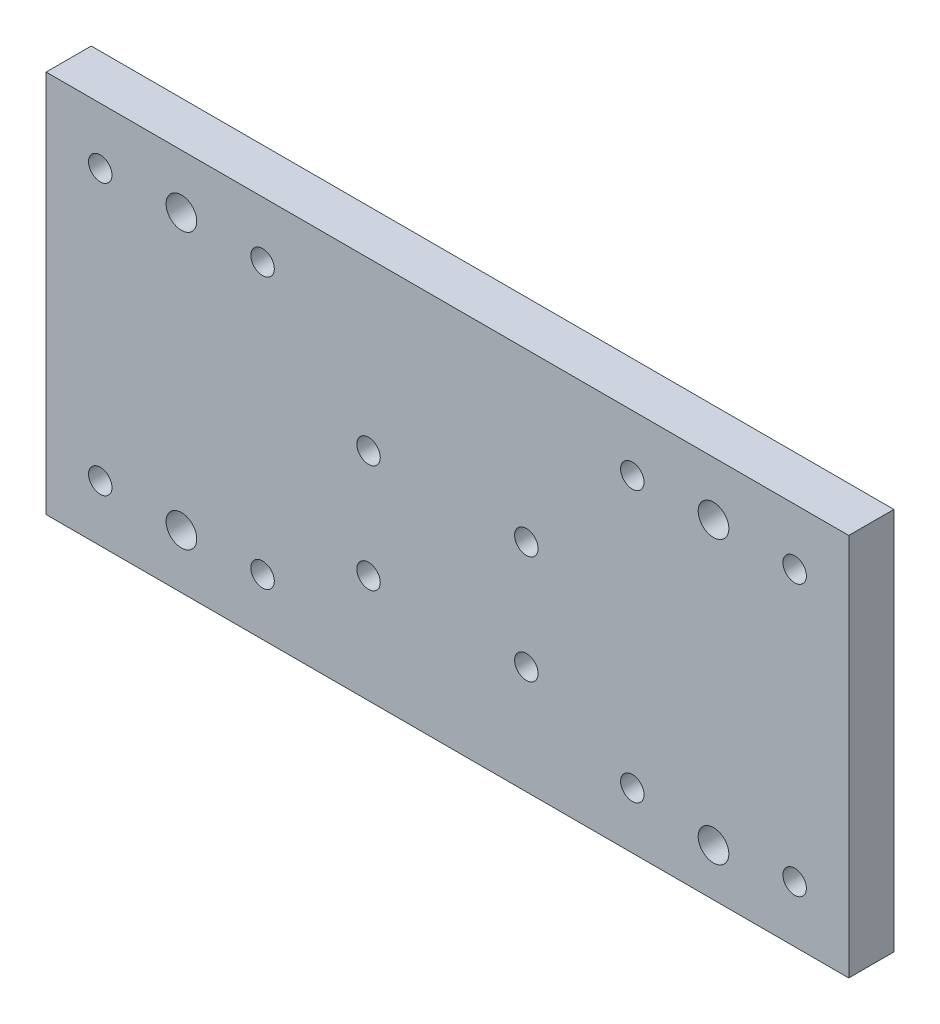
ISO-10303-21;
HEADER;
FILE_DESCRIPTION(('STEP AP214'),'2;1');
FILE_NAME('part.step','',(''),(''),'','','');
FILE_SCHEMA(('AUTOMOTIVE_DESIGN { 1 0 10303 214 1 1 1 1 }'));
ENDSEC;
DATA;
#1=APPLICATION_CONTEXT('core data for automotive mechanical design processes');
#2=APPLICATION_PROTOCOL_DEFINITION('international standard','automotive_design',2000,#1);
#3=PRODUCT_CONTEXT('',#1,'mechanical');
#4=PRODUCT('Part','Part','',(#3));
#5=PRODUCT_RELATED_PRODUCT_CATEGORY('part','',(#4));
#6=PRODUCT_DEFINITION_FORMATION('','',#4);
#7=PRODUCT_DEFINITION_CONTEXT('part definition',#1,'design');
#8=PRODUCT_DEFINITION('design','',#6,#7);
#9=PRODUCT_DEFINITION_SHAPE('','',#8);
#10=(LENGTH_UNIT() NAMED_UNIT(*) SI_UNIT(.MILLI.,.METRE.));
#11=(NAMED_UNIT(*) PLANE_ANGLE_UNIT() SI_UNIT($,.RADIAN.));
#12=(NAMED_UNIT(*) SI_UNIT($,.STERADIAN.) SOLID_ANGLE_UNIT());
#13=UNCERTAINTY_MEASURE_WITH_UNIT(LENGTH_MEASURE(1.E-05),#10,'distance_accuracy_value','');
#14=(GEOMETRIC_REPRESENTATION_CONTEXT(3) GLOBAL_UNCERTAINTY_ASSIGNED_CONTEXT((#13)) GLOBAL_UNIT_ASSIGNED_CONTEXT((#10,
#11,#12)) REPRESENTATION_CONTEXT('',''));
#15=CARTESIAN_POINT('',(0.,0.,0.));
#16=DIRECTION('',(0.,0.,1.));
#17=DIRECTION('',(1.,0.,0.));
#18=AXIS2_PLACEMENT_3D('',#15,#16,#17);
#19=CARTESIAN_POINT('',(0.,0.,10.));
#20=DIRECTION('',(0.,0.,1.));
#21=DIRECTION('',(1.,0.,0.));
#22=AXIS2_PLACEMENT_3D('',#19,#20,#21);
#23=PLANE('',#22);
#24=CARTESIAN_POINT('',(-59.,30.5,10.));
#25=DIRECTION('',(0.,0.,1.));
#26=DIRECTION('',(1.,0.,0.));
#27=AXIS2_PLACEMENT_3D('',#24,#25,#26);
#28=CIRCLE('',#27,3.39999999999999);
#29=CARTESIAN_POINT('',(-55.6,30.5,10.));
#30=VERTEX_POINT('',#29);
#31=EDGE_CURVE('E261',#30,#30,#28,.T.);
#32=ORIENTED_EDGE('',*,*,#31,.F.);
#33=EDGE_LOOP('',(#32));
#34=FACE_BOUND('',#33,.T.);
#35=CARTESIAN_POINT('',(-59.,-30.5,10.));
#36=DIRECTION('',(0.,0.,1.));
#37=DIRECTION('',(1.,0.,0.));
#38=AXIS2_PLACEMENT_3D('',#35,#36,#37);
#39=CIRCLE('',#38,3.39999999999999);
#40=CARTESIAN_POINT('',(-55.6,-30.5,10.));
#41=VERTEX_POINT('',#40);
#42=EDGE_CURVE('E253',#41,#41,#39,.T.);
#43=ORIENTED_EDGE('',*,*,#42,.F.);
#44=EDGE_LOOP('',(#43));
#45=FACE_BOUND('',#44,.T.);
#46=CARTESIAN_POINT('',(59.,-32.,10.));
#47=DIRECTION('',(0.,0.,1.));
#48=DIRECTION('',(1.,0.,0.));
#49=AXIS2_PLACEMENT_3D('',#46,#47,#48);
#50=CIRCLE('',#49,3.39999999999999);
#51=CARTESIAN_POINT('',(62.4,-32.,10.));
#52=VERTEX_POINT('',#51);
#53=EDGE_CURVE('E245',#52,#52,#50,.T.);
#54=ORIENTED_EDGE('',*,*,#53,.F.);
#55=EDGE_LOOP('',(#54));
#56=FACE_BOUND('',#55,.T.);
#57=CARTESIAN_POINT('',(59.,30.5,10.));
#58=DIRECTION('',(0.,0.,1.));
#59=DIRECTION('',(1.,0.,0.));
#60=AXIS2_PLACEMENT_3D('',#57,#58,#59);
#61=CIRCLE('',#60,3.39999999999999);
#62=CARTESIAN_POINT('',(62.4,30.5,10.));
#63=VERTEX_POINT('',#62);
#64=EDGE_CURVE('E237',#63,#63,#61,.T.);
#65=ORIENTED_EDGE('',*,*,#64,.F.);
#66=EDGE_LOOP('',(#65));
#67=FACE_BOUND('',#66,.T.);
#68=CARTESIAN_POINT('',(41.,30.,10.));
#69=DIRECTION('',(0.,0.,1.));
#70=DIRECTION('',(-1.,0.,0.));
#71=AXIS2_PLACEMENT_3D('',#68,#69,#70);
#72=CIRCLE('',#71,2.6);
#73=CARTESIAN_POINT('',(38.4,30.,10.));
#74=VERTEX_POINT('',#73);
#75=EDGE_CURVE('E214',#74,#74,#72,.T.);
#76=ORIENTED_EDGE('',*,*,#75,.F.);
#77=EDGE_LOOP('',(#76));
#78=FACE_BOUND('',#77,.T.);
#79=CARTESIAN_POINT('',(-17.5,5.50000000000001,10.));
#80=DIRECTION('',(0.,0.,1.));
#81=DIRECTION('',(1.,0.,0.));
#82=AXIS2_PLACEMENT_3D('',#79,#80,#81);
#83=CIRCLE('',#82,2.6);
#84=CARTESIAN_POINT('',(-14.9,5.50000000000001,10.));
#85=VERTEX_POINT('',#84);
#86=EDGE_CURVE('E198',#85,#85,#83,.T.);
#87=ORIENTED_EDGE('',*,*,#86,.F.);
#88=EDGE_LOOP('',(#87));
#89=FACE_BOUND('',#88,.T.);
#90=CARTESIAN_POINT('',(17.5,-18.5,10.));
#91=DIRECTION('',(0.,0.,1.));
#92=DIRECTION('',(1.,0.,0.));
#93=AXIS2_PLACEMENT_3D('',#90,#91,#92);
#94=CIRCLE('',#93,2.6);
#95=CARTESIAN_POINT('',(20.1,-18.5,10.));
#96=VERTEX_POINT('',#95);
#97=EDGE_CURVE('E182',#96,#96,#94,.T.);
#98=ORIENTED_EDGE('',*,*,#97,.F.);
#99=EDGE_LOOP('',(#98));
#100=FACE_BOUND('',#99,.T.);
#101=CARTESIAN_POINT('',(-17.5,-18.5,10.));
#102=DIRECTION('',(0.,0.,1.));
#103=DIRECTION('',(1.,0.,0.));
#104=AXIS2_PLACEMENT_3D('',#101,#102,#103);
#105=CIRCLE('',#104,2.6);
#106=CARTESIAN_POINT('',(-14.9,-18.5,10.));
#107=VERTEX_POINT('',#106);
#108=EDGE_CURVE('E166',#107,#107,#105,.T.);
#109=ORIENTED_EDGE('',*,*,#108,.F.);
#110=EDGE_LOOP('',(#109));
#111=FACE_BOUND('',#110,.T.);
#112=CARTESIAN_POINT('',(-41.,30.,10.));
#113=DIRECTION('',(0.,0.,1.));
#114=DIRECTION('',(1.,0.,0.));
#115=AXIS2_PLACEMENT_3D('',#112,#113,#114);
#116=CIRCLE('',#115,2.6);
#117=CARTESIAN_POINT('',(-38.4,30.,10.));
#118=VERTEX_POINT('',#117);
#119=EDGE_CURVE('E150',#118,#118,#116,.T.);
#120=ORIENTED_EDGE('',*,*,#119,.F.);
#121=EDGE_LOOP('',(#120));
#122=FACE_BOUND('',#121,.T.);
#123=CARTESIAN_POINT('',(-77.,-30.,10.));
#124=DIRECTION('',(0.,0.,1.));
#125=DIRECTION('',(1.,0.,0.));
#126=AXIS2_PLACEMENT_3D('',#123,#124,#125);
#127=CIRCLE('',#126,2.6);
#128=CARTESIAN_POINT('',(-74.4,-30.,10.));
#129=VERTEX_POINT('',#128);
#130=EDGE_CURVE('E120',#129,#129,#127,.T.);
#131=ORIENTED_EDGE('',*,*,#130,.F.);
#132=EDGE_LOOP('',(#131));
#133=FACE_BOUND('',#132,.T.);
#134=DIRECTION('',(0.,1.,0.));
#135=VECTOR('',#134,1.);
#136=CARTESIAN_POINT('',(89.,42.5,10.));
#137=LINE('',#136,#135);
#138=CARTESIAN_POINT('',(89.,-42.5,10.));
#139=VERTEX_POINT('',#138);
#140=CARTESIAN_POINT('',(89.,42.5,10.));
#141=VERTEX_POINT('',#140);
#142=EDGE_CURVE('E100',#139,#141,#137,.T.);
#143=ORIENTED_EDGE('',*,*,#142,.T.);
#144=DIRECTION('',(-1.,0.,0.));
#145=VECTOR('',#144,1.);
#146=CARTESIAN_POINT('',(-89.,42.5,10.));
#147=LINE('',#146,#145);
#148=CARTESIAN_POINT('',(-89.,42.5,10.));
#149=VERTEX_POINT('',#148);
#150=EDGE_CURVE('E95',#141,#149,#147,.T.);
#151=ORIENTED_EDGE('',*,*,#150,.T.);
#152=DIRECTION('',(0.,-1.,0.));
#153=VECTOR('',#152,1.);
#154=CARTESIAN_POINT('',(-89.,42.5,10.));
#155=LINE('',#154,#153);
#156=CARTESIAN_POINT('',(-89.,-42.5,10.));
#157=VERTEX_POINT('',#156);
#158=EDGE_CURVE('E98',#149,#157,#155,.T.);
#159=ORIENTED_EDGE('',*,*,#158,.T.);
#160=DIRECTION('',(1.,0.,0.));
#161=VECTOR('',#160,1.);
#162=CARTESIAN_POINT('',(-89.,-42.5,10.));
#163=LINE('',#162,#161);
#164=EDGE_CURVE('E65',#157,#139,#163,.T.);
#165=ORIENTED_EDGE('',*,*,#164,.T.);
#166=EDGE_LOOP('',(#143,#151,#159,#165));
#167=FACE_BOUND('',#166,.T.);
#168=CARTESIAN_POINT('',(-41.,-30.,10.));
#169=DIRECTION('',(0.,0.,1.));
#170=DIRECTION('',(1.,0.,0.));
#171=AXIS2_PLACEMENT_3D('',#168,#169,#170);
#172=CIRCLE('',#171,2.6);
#173=CARTESIAN_POINT('',(-38.4,-30.,10.));
#174=VERTEX_POINT('',#173);
#175=EDGE_CURVE('E142',#174,#174,#172,.T.);
#176=ORIENTED_EDGE('',*,*,#175,.F.);
#177=EDGE_LOOP('',(#176));
#178=FACE_BOUND('',#177,.T.);
#179=CARTESIAN_POINT('',(-77.,30.,10.));
#180=DIRECTION('',(0.,0.,1.));
#181=DIRECTION('',(1.,0.,0.));
#182=AXIS2_PLACEMENT_3D('',#179,#180,#181);
#183=CIRCLE('',#182,2.6);
#184=CARTESIAN_POINT('',(-74.4,30.,10.));
#185=VERTEX_POINT('',#184);
#186=EDGE_CURVE('E158',#185,#185,#183,.T.);
#187=ORIENTED_EDGE('',*,*,#186,.F.);
#188=EDGE_LOOP('',(#187));
#189=FACE_BOUND('',#188,.T.);
#190=CARTESIAN_POINT('',(77.,-30.,10.));
#191=DIRECTION('',(0.,0.,1.));
#192=DIRECTION('',(-1.,0.,0.));
#193=AXIS2_PLACEMENT_3D('',#190,#191,#192);
#194=CIRCLE('',#193,2.6);
#195=CARTESIAN_POINT('',(74.4,-30.,10.));
#196=VERTEX_POINT('',#195);
#197=EDGE_CURVE('E174',#196,#196,#194,.T.);
#198=ORIENTED_EDGE('',*,*,#197,.F.);
#199=EDGE_LOOP('',(#198));
#200=FACE_BOUND('',#199,.T.);
#201=CARTESIAN_POINT('',(17.5,5.50000000000001,10.));
#202=DIRECTION('',(0.,0.,1.));
#203=DIRECTION('',(1.,0.,0.));
#204=AXIS2_PLACEMENT_3D('',#201,#202,#203);
#205=CIRCLE('',#204,2.6);
#206=CARTESIAN_POINT('',(20.1,5.50000000000001,10.));
#207=VERTEX_POINT('',#206);
#208=EDGE_CURVE('E190',#207,#207,#205,.T.);
#209=ORIENTED_EDGE('',*,*,#208,.F.);
#210=EDGE_LOOP('',(#209));
#211=FACE_BOUND('',#210,.T.);
#212=CARTESIAN_POINT('',(41.,-30.,10.));
#213=DIRECTION('',(0.,0.,1.));
#214=DIRECTION('',(-1.,0.,0.));
#215=AXIS2_PLACEMENT_3D('',#212,#213,#214);
#216=CIRCLE('',#215,2.6);
#217=CARTESIAN_POINT('',(38.4,-30.,10.));
#218=VERTEX_POINT('',#217);
#219=EDGE_CURVE('E206',#218,#218,#216,.T.);
#220=ORIENTED_EDGE('',*,*,#219,.F.);
#221=EDGE_LOOP('',(#220));
#222=FACE_BOUND('',#221,.T.);
#223=CARTESIAN_POINT('',(77.,30.,10.));
#224=DIRECTION('',(0.,0.,1.));
#225=DIRECTION('',(-1.,0.,0.));
#226=AXIS2_PLACEMENT_3D('',#223,#224,#225);
#227=CIRCLE('',#226,2.6);
#228=CARTESIAN_POINT('',(74.4,30.,10.));
#229=VERTEX_POINT('',#228);
#230=EDGE_CURVE('E222',#229,#229,#227,.T.);
#231=ORIENTED_EDGE('',*,*,#230,.F.);
#232=EDGE_LOOP('',(#231));
#233=FACE_BOUND('',#232,.T.);
#234=ADVANCED_FACE('F47',(#34,#45,#56,#67,#78,#89,#100,#111,#122,#133,#167,#178,#189,#200,#211,
#222,#233),#23,.T.);
#235=CARTESIAN_POINT('',(0.,0.,0.));
#236=DIRECTION('',(0.,0.,1.));
#237=DIRECTION('',(1.,0.,0.));
#238=AXIS2_PLACEMENT_3D('',#235,#236,#237);
#239=PLANE('',#238);
#240=CARTESIAN_POINT('',(-59.,30.5,0.));
#241=DIRECTION('',(0.,0.,1.));
#242=DIRECTION('',(1.,0.,0.));
#243=AXIS2_PLACEMENT_3D('',#240,#241,#242);
#244=CIRCLE('',#243,3.39999999999999);
#245=CARTESIAN_POINT('',(-55.6,30.5,0.));
#246=VERTEX_POINT('',#245);
#247=EDGE_CURVE('E257',#246,#246,#244,.T.);
#248=ORIENTED_EDGE('',*,*,#247,.T.);
#249=EDGE_LOOP('',(#248));
#250=FACE_BOUND('',#249,.T.);
#251=CARTESIAN_POINT('',(-59.,-30.5,0.));
#252=DIRECTION('',(0.,0.,1.));
#253=DIRECTION('',(1.,0.,0.));
#254=AXIS2_PLACEMENT_3D('',#251,#252,#253);
#255=CIRCLE('',#254,3.39999999999999);
#256=CARTESIAN_POINT('',(-55.6,-30.5,0.));
#257=VERTEX_POINT('',#256);
#258=EDGE_CURVE('E249',#257,#257,#255,.T.);
#259=ORIENTED_EDGE('',*,*,#258,.T.);
#260=EDGE_LOOP('',(#259));
#261=FACE_BOUND('',#260,.T.);
#262=CARTESIAN_POINT('',(59.,-32.,0.));
#263=DIRECTION('',(0.,0.,1.));
#264=DIRECTION('',(1.,0.,0.));
#265=AXIS2_PLACEMENT_3D('',#262,#263,#264);
#266=CIRCLE('',#265,3.39999999999999);
#267=CARTESIAN_POINT('',(62.4,-32.,0.));
#268=VERTEX_POINT('',#267);
#269=EDGE_CURVE('E241',#268,#268,#266,.T.);
#270=ORIENTED_EDGE('',*,*,#269,.T.);
#271=EDGE_LOOP('',(#270));
#272=FACE_BOUND('',#271,.T.);
#273=CARTESIAN_POINT('',(59.,30.5,0.));
#274=DIRECTION('',(0.,0.,1.));
#275=DIRECTION('',(1.,0.,0.));
#276=AXIS2_PLACEMENT_3D('',#273,#274,#275);
#277=CIRCLE('',#276,3.39999999999999);
#278=CARTESIAN_POINT('',(62.4,30.5,0.));
#279=VERTEX_POINT('',#278);
#280=EDGE_CURVE('E230',#279,#279,#277,.T.);
#281=ORIENTED_EDGE('',*,*,#280,.T.);
#282=EDGE_LOOP('',(#281));
#283=FACE_BOUND('',#282,.T.);
#284=DIRECTION('',(0.,1.,0.));
#285=VECTOR('',#284,1.);
#286=CARTESIAN_POINT('',(89.,42.5,0.));
#287=LINE('',#286,#285);
#288=CARTESIAN_POINT('',(89.,-42.5,0.));
#289=VERTEX_POINT('',#288);
#290=CARTESIAN_POINT('',(89.,42.5,0.));
#291=VERTEX_POINT('',#290);
#292=EDGE_CURVE('E116',#289,#291,#287,.T.);
#293=ORIENTED_EDGE('',*,*,#292,.F.);
#294=DIRECTION('',(1.,0.,0.));
#295=VECTOR('',#294,1.);
#296=CARTESIAN_POINT('',(-89.,-42.5,0.));
#297=LINE('',#296,#295);
#298=CARTESIAN_POINT('',(-89.,-42.5,0.));
#299=VERTEX_POINT('',#298);
#300=EDGE_CURVE('E88',#299,#289,#297,.T.);
#301=ORIENTED_EDGE('',*,*,#300,.F.);
#302=DIRECTION('',(0.,-1.,0.));
#303=VECTOR('',#302,1.);
#304=CARTESIAN_POINT('',(-89.,42.5,0.));
#305=LINE('',#304,#303);
#306=CARTESIAN_POINT('',(-89.,42.5,0.));
#307=VERTEX_POINT('',#306);
#308=EDGE_CURVE('E82',#307,#299,#305,.T.);
#309=ORIENTED_EDGE('',*,*,#308,.F.);
#310=DIRECTION('',(-1.,0.,0.));
#311=VECTOR('',#310,1.);
#312=CARTESIAN_POINT('',(-89.,42.5,0.));
#313=LINE('',#312,#311);
#314=EDGE_CURVE('E105',#291,#307,#313,.T.);
#315=ORIENTED_EDGE('',*,*,#314,.F.);
#316=EDGE_LOOP('',(#293,#301,#309,#315));
#317=FACE_BOUND('',#316,.T.);
#318=CARTESIAN_POINT('',(-77.,-30.,0.));
#319=DIRECTION('',(0.,0.,1.));
#320=DIRECTION('',(1.,0.,0.));
#321=AXIS2_PLACEMENT_3D('',#318,#319,#320);
#322=CIRCLE('',#321,2.6);
#323=CARTESIAN_POINT('',(-74.4,-30.,0.));
#324=VERTEX_POINT('',#323);
#325=EDGE_CURVE('E138',#324,#324,#322,.T.);
#326=ORIENTED_EDGE('',*,*,#325,.T.);
#327=EDGE_LOOP('',(#326));
#328=FACE_BOUND('',#327,.T.);
#329=CARTESIAN_POINT('',(-41.,-30.,0.));
#330=DIRECTION('',(0.,0.,1.));
#331=DIRECTION('',(1.,0.,0.));
#332=AXIS2_PLACEMENT_3D('',#329,#330,#331);
#333=CIRCLE('',#332,2.6);
#334=CARTESIAN_POINT('',(-38.4,-30.,0.));
#335=VERTEX_POINT('',#334);
#336=EDGE_CURVE('E146',#335,#335,#333,.T.);
#337=ORIENTED_EDGE('',*,*,#336,.T.);
#338=EDGE_LOOP('',(#337));
#339=FACE_BOUND('',#338,.T.);
#340=CARTESIAN_POINT('',(-41.,30.,0.));
#341=DIRECTION('',(0.,0.,1.));
#342=DIRECTION('',(1.,0.,0.));
#343=AXIS2_PLACEMENT_3D('',#340,#341,#342);
#344=CIRCLE('',#343,2.6);
#345=CARTESIAN_POINT('',(-38.4,30.,0.));
#346=VERTEX_POINT('',#345);
#347=EDGE_CURVE('E154',#346,#346,#344,.T.);
#348=ORIENTED_EDGE('',*,*,#347,.T.);
#349=EDGE_LOOP('',(#348));
#350=FACE_BOUND('',#349,.T.);
#351=CARTESIAN_POINT('',(-77.,30.,0.));
#352=DIRECTION('',(0.,0.,1.));
#353=DIRECTION('',(1.,0.,0.));
#354=AXIS2_PLACEMENT_3D('',#351,#352,#353);
#355=CIRCLE('',#354,2.6);
#356=CARTESIAN_POINT('',(-74.4,30.,0.));
#357=VERTEX_POINT('',#356);
#358=EDGE_CURVE('E162',#357,#357,#355,.T.);
#359=ORIENTED_EDGE('',*,*,#358,.T.);
#360=EDGE_LOOP('',(#359));
#361=FACE_BOUND('',#360,.T.);
#362=CARTESIAN_POINT('',(-17.5,-18.5,0.));
#363=DIRECTION('',(0.,0.,1.));
#364=DIRECTION('',(1.,0.,0.));
#365=AXIS2_PLACEMENT_3D('',#362,#363,#364);
#366=CIRCLE('',#365,2.6);
#367=CARTESIAN_POINT('',(-14.9,-18.5,0.));
#368=VERTEX_POINT('',#367);
#369=EDGE_CURVE('E170',#368,#368,#366,.T.);
#370=ORIENTED_EDGE('',*,*,#369,.T.);
#371=EDGE_LOOP('',(#370));
#372=FACE_BOUND('',#371,.T.);
#373=CARTESIAN_POINT('',(77.,-30.,0.));
#374=DIRECTION('',(0.,0.,1.));
#375=DIRECTION('',(-1.,0.,0.));
#376=AXIS2_PLACEMENT_3D('',#373,#374,#375);
#377=CIRCLE('',#376,2.6);
#378=CARTESIAN_POINT('',(74.4,-30.,0.));
#379=VERTEX_POINT('',#378);
#380=EDGE_CURVE('E178',#379,#379,#377,.T.);
#381=ORIENTED_EDGE('',*,*,#380,.T.);
#382=EDGE_LOOP('',(#381));
#383=FACE_BOUND('',#382,.T.);
#384=CARTESIAN_POINT('',(17.5,-18.5,0.));
#385=DIRECTION('',(0.,0.,1.));
#386=DIRECTION('',(1.,0.,0.));
#387=AXIS2_PLACEMENT_3D('',#384,#385,#386);
#388=CIRCLE('',#387,2.6);
#389=CARTESIAN_POINT('',(20.1,-18.5,0.));
#390=VERTEX_POINT('',#389);
#391=EDGE_CURVE('E186',#390,#390,#388,.T.);
#392=ORIENTED_EDGE('',*,*,#391,.T.);
#393=EDGE_LOOP('',(#392));
#394=FACE_BOUND('',#393,.T.);
#395=CARTESIAN_POINT('',(17.5,5.50000000000001,0.));
#396=DIRECTION('',(0.,0.,1.));
#397=DIRECTION('',(1.,0.,0.));
#398=AXIS2_PLACEMENT_3D('',#395,#396,#397);
#399=CIRCLE('',#398,2.6);
#400=CARTESIAN_POINT('',(20.1,5.50000000000001,0.));
#401=VERTEX_POINT('',#400);
#402=EDGE_CURVE('E194',#401,#401,#399,.T.);
#403=ORIENTED_EDGE('',*,*,#402,.T.);
#404=EDGE_LOOP('',(#403));
#405=FACE_BOUND('',#404,.T.);
#406=CARTESIAN_POINT('',(-17.5,5.50000000000001,0.));
#407=DIRECTION('',(0.,0.,1.));
#408=DIRECTION('',(1.,0.,0.));
#409=AXIS2_PLACEMENT_3D('',#406,#407,#408);
#410=CIRCLE('',#409,2.6);
#411=CARTESIAN_POINT('',(-14.9,5.50000000000001,0.));
#412=VERTEX_POINT('',#411);
#413=EDGE_CURVE('E202',#412,#412,#410,.T.);
#414=ORIENTED_EDGE('',*,*,#413,.T.);
#415=EDGE_LOOP('',(#414));
#416=FACE_BOUND('',#415,.T.);
#417=CARTESIAN_POINT('',(41.,-30.,0.));
#418=DIRECTION('',(0.,0.,1.));
#419=DIRECTION('',(-1.,0.,0.));
#420=AXIS2_PLACEMENT_3D('',#417,#418,#419);
#421=CIRCLE('',#420,2.6);
#422=CARTESIAN_POINT('',(38.4,-30.,0.));
#423=VERTEX_POINT('',#422);
#424=EDGE_CURVE('E210',#423,#423,#421,.T.);
#425=ORIENTED_EDGE('',*,*,#424,.T.);
#426=EDGE_LOOP('',(#425));
#427=FACE_BOUND('',#426,.T.);
#428=CARTESIAN_POINT('',(41.,30.,0.));
#429=DIRECTION('',(0.,0.,1.));
#430=DIRECTION('',(-1.,0.,0.));
#431=AXIS2_PLACEMENT_3D('',#428,#429,#430);
#432=CIRCLE('',#431,2.6);
#433=CARTESIAN_POINT('',(38.4,30.,0.));
#434=VERTEX_POINT('',#433);
#435=EDGE_CURVE('E218',#434,#434,#432,.T.);
#436=ORIENTED_EDGE('',*,*,#435,.T.);
#437=EDGE_LOOP('',(#436));
#438=FACE_BOUND('',#437,.T.);
#439=CARTESIAN_POINT('',(77.,30.,0.));
#440=DIRECTION('',(0.,0.,1.));
#441=DIRECTION('',(-1.,0.,0.));
#442=AXIS2_PLACEMENT_3D('',#439,#440,#441);
#443=CIRCLE('',#442,2.6);
#444=CARTESIAN_POINT('',(74.4,30.,0.));
#445=VERTEX_POINT('',#444);
#446=EDGE_CURVE('E226',#445,#445,#443,.T.);
#447=ORIENTED_EDGE('',*,*,#446,.T.);
#448=EDGE_LOOP('',(#447));
#449=FACE_BOUND('',#448,.T.);
#450=ADVANCED_FACE('F133',(#250,#261,#272,#283,#317,#328,#339,#350,#361,#372,#383,#394,#405,
#416,#427,#438,#449),#239,.F.);
#451=CARTESIAN_POINT('',(89.,42.5,10.));
#452=DIRECTION('',(-1.,0.,0.));
#453=DIRECTION('',(0.,-1.,0.));
#454=AXIS2_PLACEMENT_3D('',#451,#452,#453);
#455=PLANE('',#454);
#456=ORIENTED_EDGE('',*,*,#292,.T.);
#457=DIRECTION('',(0.,0.,-1.));
#458=VECTOR('',#457,1.);
#459=CARTESIAN_POINT('',(89.,42.5,10.));
#460=LINE('',#459,#458);
#461=EDGE_CURVE('E11',#141,#291,#460,.T.);
#462=ORIENTED_EDGE('',*,*,#461,.F.);
#463=ORIENTED_EDGE('',*,*,#142,.F.);
#464=DIRECTION('',(0.,0.,-1.));
#465=VECTOR('',#464,1.);
#466=CARTESIAN_POINT('',(89.,-42.5,10.));
#467=LINE('',#466,#465);
#468=EDGE_CURVE('E112',#139,#289,#467,.T.);
#469=ORIENTED_EDGE('',*,*,#468,.T.);
#470=EDGE_LOOP('',(#456,#462,#463,#469));
#471=FACE_BOUND('',#470,.T.);
#472=ADVANCED_FACE('F49',(#471),#455,.F.);
#473=CARTESIAN_POINT('',(-89.,42.5,10.));
#474=DIRECTION('',(0.,-1.,0.));
#475=DIRECTION('',(1.,0.,0.));
#476=AXIS2_PLACEMENT_3D('',#473,#474,#475);
#477=PLANE('',#476);
#478=ORIENTED_EDGE('',*,*,#314,.T.);
#479=DIRECTION('',(0.,0.,-1.));
#480=VECTOR('',#479,1.);
#481=CARTESIAN_POINT('',(-89.,42.5,10.));
#482=LINE('',#481,#480);
#483=EDGE_CURVE('E57',#149,#307,#482,.T.);
#484=ORIENTED_EDGE('',*,*,#483,.F.);
#485=ORIENTED_EDGE('',*,*,#150,.F.);
#486=ORIENTED_EDGE('',*,*,#461,.T.);
#487=EDGE_LOOP('',(#478,#484,#485,#486));
#488=FACE_BOUND('',#487,.T.);
#489=ADVANCED_FACE('F104',(#488),#477,.F.);
#490=CARTESIAN_POINT('',(-89.,42.5,10.));
#491=DIRECTION('',(1.,0.,0.));
#492=DIRECTION('',(0.,1.,0.));
#493=AXIS2_PLACEMENT_3D('',#490,#491,#492);
#494=PLANE('',#493);
#495=ORIENTED_EDGE('',*,*,#308,.T.);
#496=DIRECTION('',(0.,0.,-1.));
#497=VECTOR('',#496,1.);
#498=CARTESIAN_POINT('',(-89.,-42.5,10.));
#499=LINE('',#498,#497);
#500=EDGE_CURVE('E107',#157,#299,#499,.T.);
#501=ORIENTED_EDGE('',*,*,#500,.F.);
#502=ORIENTED_EDGE('',*,*,#158,.F.);
#503=ORIENTED_EDGE('',*,*,#483,.T.);
#504=EDGE_LOOP('',(#495,#501,#502,#503));
#505=FACE_BOUND('',#504,.T.);
#506=ADVANCED_FACE('F108',(#505),#494,.F.);
#507=CARTESIAN_POINT('',(-89.,-42.5,10.));
#508=DIRECTION('',(0.,1.,0.));
#509=DIRECTION('',(-1.,0.,0.));
#510=AXIS2_PLACEMENT_3D('',#507,#508,#509);
#511=PLANE('',#510);
#512=ORIENTED_EDGE('',*,*,#300,.T.);
#513=ORIENTED_EDGE('',*,*,#468,.F.);
#514=ORIENTED_EDGE('',*,*,#164,.F.);
#515=ORIENTED_EDGE('',*,*,#500,.T.);
#516=EDGE_LOOP('',(#512,#513,#514,#515));
#517=FACE_BOUND('',#516,.T.);
#518=ADVANCED_FACE('F130',(#517),#511,.F.);
#519=CARTESIAN_POINT('',(-77.,-30.,10.));
#520=DIRECTION('',(0.,0.,-1.));
#521=DIRECTION('',(-1.,0.,0.));
#522=AXIS2_PLACEMENT_3D('',#519,#520,#521);
#523=CYLINDRICAL_SURFACE('',#522,2.6);
#524=ORIENTED_EDGE('',*,*,#130,.T.);
#525=EDGE_LOOP('',(#524));
#526=FACE_BOUND('',#525,.T.);
#527=ORIENTED_EDGE('',*,*,#325,.F.);
#528=EDGE_LOOP('',(#527));
#529=FACE_BOUND('',#528,.T.);
#530=ADVANCED_FACE('F289',(#526,#529),#523,.F.);
#531=CARTESIAN_POINT('',(-41.,-30.,10.));
#532=DIRECTION('',(0.,0.,-1.));
#533=DIRECTION('',(-1.,0.,0.));
#534=AXIS2_PLACEMENT_3D('',#531,#532,#533);
#535=CYLINDRICAL_SURFACE('',#534,2.6);
#536=ORIENTED_EDGE('',*,*,#175,.T.);
#537=EDGE_LOOP('',(#536));
#538=FACE_BOUND('',#537,.T.);
#539=ORIENTED_EDGE('',*,*,#336,.F.);
#540=EDGE_LOOP('',(#539));
#541=FACE_BOUND('',#540,.T.);
#542=ADVANCED_FACE('F292',(#538,#541),#535,.F.);
#543=CARTESIAN_POINT('',(-41.,30.,10.));
#544=DIRECTION('',(0.,0.,-1.));
#545=DIRECTION('',(-1.,0.,0.));
#546=AXIS2_PLACEMENT_3D('',#543,#544,#545);
#547=CYLINDRICAL_SURFACE('',#546,2.6);
#548=ORIENTED_EDGE('',*,*,#119,.T.);
#549=EDGE_LOOP('',(#548));
#550=FACE_BOUND('',#549,.T.);
#551=ORIENTED_EDGE('',*,*,#347,.F.);
#552=EDGE_LOOP('',(#551));
#553=FACE_BOUND('',#552,.T.);
#554=ADVANCED_FACE('F365',(#550,#553),#547,.F.);
#555=CARTESIAN_POINT('',(-77.,30.,10.));
#556=DIRECTION('',(0.,0.,-1.));
#557=DIRECTION('',(-1.,0.,0.));
#558=AXIS2_PLACEMENT_3D('',#555,#556,#557);
#559=CYLINDRICAL_SURFACE('',#558,2.6);
#560=ORIENTED_EDGE('',*,*,#186,.T.);
#561=EDGE_LOOP('',(#560));
#562=FACE_BOUND('',#561,.T.);
#563=ORIENTED_EDGE('',*,*,#358,.F.);
#564=EDGE_LOOP('',(#563));
#565=FACE_BOUND('',#564,.T.);
#566=ADVANCED_FACE('F361',(#562,#565),#559,.F.);
#567=CARTESIAN_POINT('',(-17.5,-18.5,10.));
#568=DIRECTION('',(0.,0.,-1.));
#569=DIRECTION('',(-1.,0.,0.));
#570=AXIS2_PLACEMENT_3D('',#567,#568,#569);
#571=CYLINDRICAL_SURFACE('',#570,2.6);
#572=ORIENTED_EDGE('',*,*,#108,.T.);
#573=EDGE_LOOP('',(#572));
#574=FACE_BOUND('',#573,.T.);
#575=ORIENTED_EDGE('',*,*,#369,.F.);
#576=EDGE_LOOP('',(#575));
#577=FACE_BOUND('',#576,.T.);
#578=ADVANCED_FACE('F357',(#574,#577),#571,.F.);
#579=CARTESIAN_POINT('',(77.,-30.,10.));
#580=DIRECTION('',(0.,0.,-1.));
#581=DIRECTION('',(-1.,0.,0.));
#582=AXIS2_PLACEMENT_3D('',#579,#580,#581);
#583=CYLINDRICAL_SURFACE('',#582,2.6);
#584=ORIENTED_EDGE('',*,*,#197,.T.);
#585=EDGE_LOOP('',(#584));
#586=FACE_BOUND('',#585,.T.);
#587=ORIENTED_EDGE('',*,*,#380,.F.);
#588=EDGE_LOOP('',(#587));
#589=FACE_BOUND('',#588,.T.);
#590=ADVANCED_FACE('F353',(#586,#589),#583,.F.);
#591=CARTESIAN_POINT('',(17.5,-18.5,10.));
#592=DIRECTION('',(0.,0.,-1.));
#593=DIRECTION('',(-1.,0.,0.));
#594=AXIS2_PLACEMENT_3D('',#591,#592,#593);
#595=CYLINDRICAL_SURFACE('',#594,2.6);
#596=ORIENTED_EDGE('',*,*,#97,.T.);
#597=EDGE_LOOP('',(#596));
#598=FACE_BOUND('',#597,.T.);
#599=ORIENTED_EDGE('',*,*,#391,.F.);
#600=EDGE_LOOP('',(#599));
#601=FACE_BOUND('',#600,.T.);
#602=ADVANCED_FACE('F349',(#598,#601),#595,.F.);
#603=CARTESIAN_POINT('',(17.5,5.50000000000001,10.));
#604=DIRECTION('',(0.,0.,-1.));
#605=DIRECTION('',(-1.,0.,0.));
#606=AXIS2_PLACEMENT_3D('',#603,#604,#605);
#607=CYLINDRICAL_SURFACE('',#606,2.6);
#608=ORIENTED_EDGE('',*,*,#208,.T.);
#609=EDGE_LOOP('',(#608));
#610=FACE_BOUND('',#609,.T.);
#611=ORIENTED_EDGE('',*,*,#402,.F.);
#612=EDGE_LOOP('',(#611));
#613=FACE_BOUND('',#612,.T.);
#614=ADVANCED_FACE('F345',(#610,#613),#607,.F.);
#615=CARTESIAN_POINT('',(-17.5,5.50000000000001,10.));
#616=DIRECTION('',(0.,0.,-1.));
#617=DIRECTION('',(-1.,0.,0.));
#618=AXIS2_PLACEMENT_3D('',#615,#616,#617);
#619=CYLINDRICAL_SURFACE('',#618,2.6);
#620=ORIENTED_EDGE('',*,*,#86,.T.);
#621=EDGE_LOOP('',(#620));
#622=FACE_BOUND('',#621,.T.);
#623=ORIENTED_EDGE('',*,*,#413,.F.);
#624=EDGE_LOOP('',(#623));
#625=FACE_BOUND('',#624,.T.);
#626=ADVANCED_FACE('F341',(#622,#625),#619,.F.);
#627=CARTESIAN_POINT('',(41.,-30.,10.));
#628=DIRECTION('',(0.,0.,-1.));
#629=DIRECTION('',(-1.,0.,0.));
#630=AXIS2_PLACEMENT_3D('',#627,#628,#629);
#631=CYLINDRICAL_SURFACE('',#630,2.6);
#632=ORIENTED_EDGE('',*,*,#219,.T.);
#633=EDGE_LOOP('',(#632));
#634=FACE_BOUND('',#633,.T.);
#635=ORIENTED_EDGE('',*,*,#424,.F.);
#636=EDGE_LOOP('',(#635));
#637=FACE_BOUND('',#636,.T.);
#638=ADVANCED_FACE('F334',(#634,#637),#631,.F.);
#639=CARTESIAN_POINT('',(41.,30.,10.));
#640=DIRECTION('',(0.,0.,-1.));
#641=DIRECTION('',(-1.,0.,0.));
#642=AXIS2_PLACEMENT_3D('',#639,#640,#641);
#643=CYLINDRICAL_SURFACE('',#642,2.6);
#644=ORIENTED_EDGE('',*,*,#75,.T.);
#645=EDGE_LOOP('',(#644));
#646=FACE_BOUND('',#645,.T.);
#647=ORIENTED_EDGE('',*,*,#435,.F.);
#648=EDGE_LOOP('',(#647));
#649=FACE_BOUND('',#648,.T.);
#650=ADVANCED_FACE('F324',(#646,#649),#643,.F.);
#651=CARTESIAN_POINT('',(77.,30.,10.));
#652=DIRECTION('',(0.,0.,-1.));
#653=DIRECTION('',(-1.,0.,0.));
#654=AXIS2_PLACEMENT_3D('',#651,#652,#653);
#655=CYLINDRICAL_SURFACE('',#654,2.6);
#656=ORIENTED_EDGE('',*,*,#230,.T.);
#657=EDGE_LOOP('',(#656));
#658=FACE_BOUND('',#657,.T.);
#659=ORIENTED_EDGE('',*,*,#446,.F.);
#660=EDGE_LOOP('',(#659));
#661=FACE_BOUND('',#660,.T.);
#662=ADVANCED_FACE('F321',(#658,#661),#655,.F.);
#663=CARTESIAN_POINT('',(59.,30.5,10.));
#664=DIRECTION('',(0.,0.,1.));
#665=DIRECTION('',(1.,0.,0.));
#666=AXIS2_PLACEMENT_3D('',#663,#664,#665);
#667=CYLINDRICAL_SURFACE('',#666,3.39999999999999);
#668=ORIENTED_EDGE('',*,*,#280,.F.);
#669=EDGE_LOOP('',(#668));
#670=FACE_BOUND('',#669,.T.);
#671=ORIENTED_EDGE('',*,*,#64,.T.);
#672=EDGE_LOOP('',(#671));
#673=FACE_BOUND('',#672,.T.);
#674=ADVANCED_FACE('F323',(#670,#673),#667,.F.);
#675=CARTESIAN_POINT('',(59.,-32.,10.));
#676=DIRECTION('',(0.,0.,1.));
#677=DIRECTION('',(1.,0.,0.));
#678=AXIS2_PLACEMENT_3D('',#675,#676,#677);
#679=CYLINDRICAL_SURFACE('',#678,3.39999999999999);
#680=ORIENTED_EDGE('',*,*,#269,.F.);
#681=EDGE_LOOP('',(#680));
#682=FACE_BOUND('',#681,.T.);
#683=ORIENTED_EDGE('',*,*,#53,.T.);
#684=EDGE_LOOP('',(#683));
#685=FACE_BOUND('',#684,.T.);
#686=ADVANCED_FACE('F331',(#682,#685),#679,.F.);
#687=CARTESIAN_POINT('',(-59.,-30.5,10.));
#688=DIRECTION('',(0.,0.,1.));
#689=DIRECTION('',(1.,0.,0.));
#690=AXIS2_PLACEMENT_3D('',#687,#688,#689);
#691=CYLINDRICAL_SURFACE('',#690,3.39999999999999);
#692=ORIENTED_EDGE('',*,*,#258,.F.);
#693=EDGE_LOOP('',(#692));
#694=FACE_BOUND('',#693,.T.);
#695=ORIENTED_EDGE('',*,*,#42,.T.);
#696=EDGE_LOOP('',(#695));
#697=FACE_BOUND('',#696,.T.);
#698=ADVANCED_FACE('F485',(#694,#697),#691,.F.);
#699=CARTESIAN_POINT('',(-59.,30.5,10.));
#700=DIRECTION('',(0.,0.,1.));
#701=DIRECTION('',(1.,0.,0.));
#702=AXIS2_PLACEMENT_3D('',#699,#700,#701);
#703=CYLINDRICAL_SURFACE('',#702,3.39999999999999);
#704=ORIENTED_EDGE('',*,*,#247,.F.);
#705=EDGE_LOOP('',(#704));
#706=FACE_BOUND('',#705,.T.);
#707=ORIENTED_EDGE('',*,*,#31,.T.);
#708=EDGE_LOOP('',(#707));
#709=FACE_BOUND('',#708,.T.);
#710=ADVANCED_FACE('F266',(#706,#709),#703,.F.);
#711=CLOSED_SHELL('',(#234,#450,#472,#489,#506,#518,#530,#542,#554,#566,#578,#590,#602,#614,
#626,#638,#650,#662,#674,#686,#698,#710));
#712=MANIFOLD_SOLID_BREP('B2',#711);
#713=ADVANCED_BREP_SHAPE_REPRESENTATION('',(#18,#712),#14);
#714=SHAPE_DEFINITION_REPRESENTATION(#9,#713);
ENDSEC;
END-ISO-10303-21;
